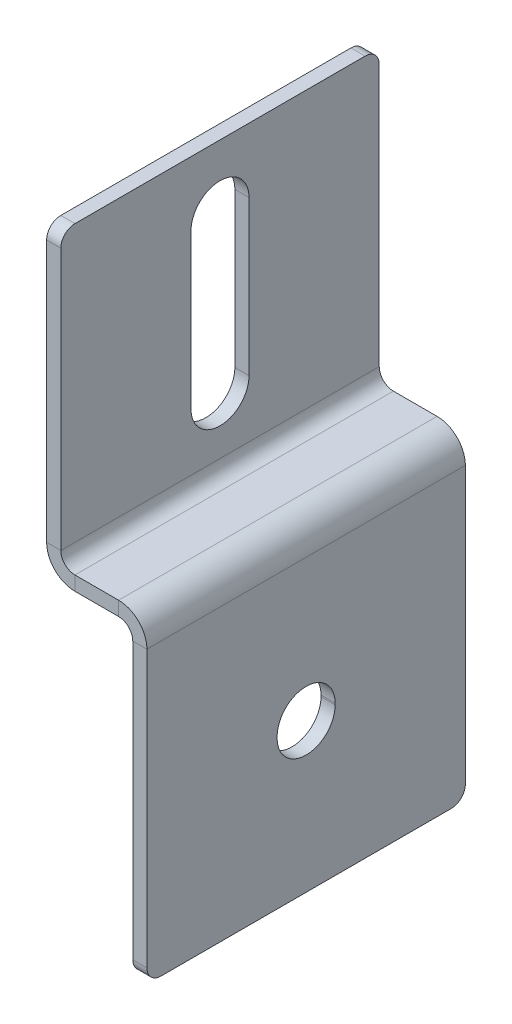
ISO-10303-21;
HEADER;
FILE_DESCRIPTION(('STEP AP214'),'2;1');
FILE_NAME('part.step','',(''),(''),'','','');
FILE_SCHEMA(('AUTOMOTIVE_DESIGN { 1 0 10303 214 1 1 1 1 }'));
ENDSEC;
DATA;
#1=APPLICATION_CONTEXT('core data for automotive mechanical design processes');
#2=APPLICATION_PROTOCOL_DEFINITION('international standard','automotive_design',2000,#1);
#3=PRODUCT_CONTEXT('',#1,'mechanical');
#4=PRODUCT('Part','Part','',(#3));
#5=PRODUCT_RELATED_PRODUCT_CATEGORY('part','',(#4));
#6=PRODUCT_DEFINITION_FORMATION('','',#4);
#7=PRODUCT_DEFINITION_CONTEXT('part definition',#1,'design');
#8=PRODUCT_DEFINITION('design','',#6,#7);
#9=PRODUCT_DEFINITION_SHAPE('','',#8);
#10=(LENGTH_UNIT() NAMED_UNIT(*) SI_UNIT(.MILLI.,.METRE.));
#11=(NAMED_UNIT(*) PLANE_ANGLE_UNIT() SI_UNIT($,.RADIAN.));
#12=(NAMED_UNIT(*) SI_UNIT($,.STERADIAN.) SOLID_ANGLE_UNIT());
#13=UNCERTAINTY_MEASURE_WITH_UNIT(LENGTH_MEASURE(1.E-05),#10,'distance_accuracy_value','');
#14=(GEOMETRIC_REPRESENTATION_CONTEXT(3) GLOBAL_UNCERTAINTY_ASSIGNED_CONTEXT((#13)) GLOBAL_UNIT_ASSIGNED_CONTEXT((#10,
#11,#12)) REPRESENTATION_CONTEXT('',''));
#15=CARTESIAN_POINT('',(0.,0.,0.));
#16=DIRECTION('',(0.,0.,1.));
#17=DIRECTION('',(1.,0.,0.));
#18=AXIS2_PLACEMENT_3D('',#15,#16,#17);
#19=CARTESIAN_POINT('',(0.,-24.1,26.6));
#20=DIRECTION('',(0.,0.,-1.));
#21=DIRECTION('',(0.,-1.,0.));
#22=AXIS2_PLACEMENT_3D('',#19,#20,#21);
#23=PLANE('',#22);
#24=DIRECTION('',(1.,0.,0.));
#25=VECTOR('',#24,1.);
#26=CARTESIAN_POINT('',(0.,-24.1,26.6));
#27=LINE('',#26,#25);
#28=CARTESIAN_POINT('',(-2.,-24.1,26.6));
#29=VERTEX_POINT('',#28);
#30=CARTESIAN_POINT('',(0.,-24.1,26.6));
#31=VERTEX_POINT('',#30);
#32=EDGE_CURVE('E205',#29,#31,#27,.T.);
#33=ORIENTED_EDGE('',*,*,#32,.F.);
#34=DIRECTION('',(0.,-1.,0.));
#35=VECTOR('',#34,1.);
#36=CARTESIAN_POINT('',(-2.,0.,26.6));
#37=LINE('',#36,#35);
#38=CARTESIAN_POINT('',(-2.,-23.9,26.6));
#39=VERTEX_POINT('',#38);
#40=EDGE_CURVE('E325',#39,#29,#37,.T.);
#41=ORIENTED_EDGE('',*,*,#40,.F.);
#42=DIRECTION('',(1.,0.,0.));
#43=VECTOR('',#42,1.);
#44=CARTESIAN_POINT('',(0.,-23.9,26.6));
#45=LINE('',#44,#43);
#46=CARTESIAN_POINT('',(0.,-23.9,26.6));
#47=VERTEX_POINT('',#46);
#48=EDGE_CURVE('E354',#39,#47,#45,.T.);
#49=ORIENTED_EDGE('',*,*,#48,.T.);
#50=DIRECTION('',(0.,-1.,0.));
#51=VECTOR('',#50,1.);
#52=CARTESIAN_POINT('',(0.,-24.1,26.6));
#53=LINE('',#52,#51);
#54=EDGE_CURVE('E206',#47,#31,#53,.T.);
#55=ORIENTED_EDGE('',*,*,#54,.T.);
#56=EDGE_LOOP('',(#33,#41,#49,#55));
#57=FACE_BOUND('',#56,.T.);
#58=ADVANCED_FACE('F16',(#57),#23,.T.);
#59=CARTESIAN_POINT('',(0.,-23.9,22.5));
#60=DIRECTION('',(-1.,0.,0.));
#61=DIRECTION('',(0.,-1.,0.));
#62=AXIS2_PLACEMENT_3D('',#59,#60,#61);
#63=CYLINDRICAL_SURFACE('',#62,4.09999999999999);
#64=ORIENTED_EDGE('',*,*,#48,.F.);
#65=CARTESIAN_POINT('',(-1.99999999999998,-23.9,22.5));
#66=DIRECTION('',(1.,0.,0.));
#67=DIRECTION('',(0.,1.,0.));
#68=AXIS2_PLACEMENT_3D('',#65,#66,#67);
#69=CIRCLE('',#68,4.09999999999999);
#70=CARTESIAN_POINT('',(-2.,-23.9,18.4));
#71=VERTEX_POINT('',#70);
#72=EDGE_CURVE('E311',#71,#39,#69,.T.);
#73=ORIENTED_EDGE('',*,*,#72,.F.);
#74=DIRECTION('',(1.,0.,0.));
#75=VECTOR('',#74,1.);
#76=CARTESIAN_POINT('',(0.,-23.9,18.4));
#77=LINE('',#76,#75);
#78=CARTESIAN_POINT('',(0.,-23.9,18.4));
#79=VERTEX_POINT('',#78);
#80=EDGE_CURVE('E190',#71,#79,#77,.T.);
#81=ORIENTED_EDGE('',*,*,#80,.T.);
#82=CARTESIAN_POINT('',(0.,-23.9,22.5));
#83=DIRECTION('',(1.,0.,0.));
#84=DIRECTION('',(0.,1.,0.));
#85=AXIS2_PLACEMENT_3D('',#82,#83,#84);
#86=CIRCLE('',#85,4.09999999999999);
#87=EDGE_CURVE('E201',#79,#47,#86,.T.);
#88=ORIENTED_EDGE('',*,*,#87,.T.);
#89=EDGE_LOOP('',(#64,#73,#81,#88));
#90=FACE_BOUND('',#89,.T.);
#91=ADVANCED_FACE('F489',(#90),#63,.F.);
#92=CARTESIAN_POINT('',(0.,-24.1,18.4));
#93=DIRECTION('',(0.,0.,1.));
#94=DIRECTION('',(0.,1.,0.));
#95=AXIS2_PLACEMENT_3D('',#92,#93,#94);
#96=PLANE('',#95);
#97=ORIENTED_EDGE('',*,*,#80,.F.);
#98=DIRECTION('',(0.,-1.,0.));
#99=VECTOR('',#98,1.);
#100=CARTESIAN_POINT('',(-2.,0.,18.4));
#101=LINE('',#100,#99);
#102=CARTESIAN_POINT('',(-2.,-24.1,18.4));
#103=VERTEX_POINT('',#102);
#104=EDGE_CURVE('E185',#103,#71,#101,.F.);
#105=ORIENTED_EDGE('',*,*,#104,.F.);
#106=DIRECTION('',(1.,0.,0.));
#107=VECTOR('',#106,1.);
#108=CARTESIAN_POINT('',(0.,-24.1,18.4));
#109=LINE('',#108,#107);
#110=CARTESIAN_POINT('',(0.,-24.1,18.4));
#111=VERTEX_POINT('',#110);
#112=EDGE_CURVE('E179',#103,#111,#109,.T.);
#113=ORIENTED_EDGE('',*,*,#112,.T.);
#114=DIRECTION('',(0.,1.,0.));
#115=VECTOR('',#114,1.);
#116=CARTESIAN_POINT('',(0.,-24.1,18.4));
#117=LINE('',#116,#115);
#118=EDGE_CURVE('E182',#111,#79,#117,.T.);
#119=ORIENTED_EDGE('',*,*,#118,.T.);
#120=EDGE_LOOP('',(#97,#105,#113,#119));
#121=FACE_BOUND('',#120,.T.);
#122=ADVANCED_FACE('F181',(#121),#96,.T.);
#123=CARTESIAN_POINT('',(-12.17,0.,45.));
#124=DIRECTION('',(0.,0.,1.));
#125=DIRECTION('',(-1.,0.,0.));
#126=AXIS2_PLACEMENT_3D('',#123,#124,#125);
#127=PLANE('',#126);
#128=DIRECTION('',(0.,1.,0.));
#129=VECTOR('',#128,1.);
#130=CARTESIAN_POINT('',(-10.17,0.,45.));
#131=LINE('',#130,#129);
#132=CARTESIAN_POINT('',(-10.17,-1.99999999999999,45.));
#133=VERTEX_POINT('',#132);
#134=CARTESIAN_POINT('',(-10.17,0.,45.));
#135=VERTEX_POINT('',#134);
#136=EDGE_CURVE('E191',#133,#135,#131,.T.);
#137=ORIENTED_EDGE('',*,*,#136,.F.);
#138=DIRECTION('',(1.,0.,0.));
#139=VECTOR('',#138,1.);
#140=CARTESIAN_POINT('',(-12.17,-2.,45.));
#141=LINE('',#140,#139);
#142=CARTESIAN_POINT('',(-4.00000000000001,-2.,45.));
#143=VERTEX_POINT('',#142);
#144=EDGE_CURVE('E303',#143,#133,#141,.F.);
#145=ORIENTED_EDGE('',*,*,#144,.F.);
#146=DIRECTION('',(0.,1.,0.));
#147=VECTOR('',#146,1.);
#148=CARTESIAN_POINT('',(-4.,0.,45.));
#149=LINE('',#148,#147);
#150=CARTESIAN_POINT('',(-4.,0.,45.));
#151=VERTEX_POINT('',#150);
#152=EDGE_CURVE('E349',#143,#151,#149,.T.);
#153=ORIENTED_EDGE('',*,*,#152,.T.);
#154=DIRECTION('',(-1.,0.,0.));
#155=VECTOR('',#154,1.);
#156=CARTESIAN_POINT('',(-12.17,0.,45.));
#157=LINE('',#156,#155);
#158=EDGE_CURVE('E202',#151,#135,#157,.T.);
#159=ORIENTED_EDGE('',*,*,#158,.T.);
#160=EDGE_LOOP('',(#137,#145,#153,#159));
#161=FACE_BOUND('',#160,.T.);
#162=ADVANCED_FACE('F417',(#161),#127,.T.);
#163=CARTESIAN_POINT('',(-4.,-4.,45.));
#164=DIRECTION('',(0.,0.,-1.));
#165=DIRECTION('',(-1.,0.,0.));
#166=AXIS2_PLACEMENT_3D('',#163,#164,#165);
#167=PLANE('',#166);
#168=ORIENTED_EDGE('',*,*,#152,.F.);
#169=CARTESIAN_POINT('',(-4.,-4.,45.));
#170=DIRECTION('',(0.,0.,-1.));
#171=DIRECTION('',(-1.,0.,0.));
#172=AXIS2_PLACEMENT_3D('',#169,#170,#171);
#173=CIRCLE('',#172,2.);
#174=CARTESIAN_POINT('',(-2.,-4.,45.));
#175=VERTEX_POINT('',#174);
#176=EDGE_CURVE('E304',#143,#175,#173,.T.);
#177=ORIENTED_EDGE('',*,*,#176,.T.);
#178=DIRECTION('',(1.,0.,0.));
#179=VECTOR('',#178,1.);
#180=CARTESIAN_POINT('',(0.,-4.,45.));
#181=LINE('',#180,#179);
#182=CARTESIAN_POINT('',(0.,-4.,45.));
#183=VERTEX_POINT('',#182);
#184=EDGE_CURVE('E346',#175,#183,#181,.T.);
#185=ORIENTED_EDGE('',*,*,#184,.T.);
#186=CARTESIAN_POINT('',(-4.,-4.,45.));
#187=DIRECTION('',(0.,0.,1.));
#188=DIRECTION('',(1.,0.,0.));
#189=AXIS2_PLACEMENT_3D('',#186,#187,#188);
#190=CIRCLE('',#189,4.);
#191=EDGE_CURVE('E248',#151,#183,#190,.F.);
#192=ORIENTED_EDGE('',*,*,#191,.F.);
#193=EDGE_LOOP('',(#168,#177,#185,#192));
#194=FACE_BOUND('',#193,.T.);
#195=ADVANCED_FACE('F450',(#194),#167,.F.);
#196=CARTESIAN_POINT('',(0.,0.,45.));
#197=DIRECTION('',(0.,0.,1.));
#198=DIRECTION('',(0.,1.,0.));
#199=AXIS2_PLACEMENT_3D('',#196,#197,#198);
#200=PLANE('',#199);
#201=DIRECTION('',(0.,-1.,0.));
#202=VECTOR('',#201,1.);
#203=CARTESIAN_POINT('',(-2.,0.,45.));
#204=LINE('',#203,#202);
#205=CARTESIAN_POINT('',(-1.99999999999999,-43.,45.));
#206=VERTEX_POINT('',#205);
#207=EDGE_CURVE('E310',#206,#175,#204,.F.);
#208=ORIENTED_EDGE('',*,*,#207,.F.);
#209=DIRECTION('',(-1.,0.,0.));
#210=VECTOR('',#209,1.);
#211=CARTESIAN_POINT('',(0.,-43.,45.));
#212=LINE('',#211,#210);
#213=CARTESIAN_POINT('',(0.,-43.,45.));
#214=VERTEX_POINT('',#213);
#215=EDGE_CURVE('E372',#206,#214,#212,.F.);
#216=ORIENTED_EDGE('',*,*,#215,.T.);
#217=DIRECTION('',(0.,1.,0.));
#218=VECTOR('',#217,1.);
#219=CARTESIAN_POINT('',(0.,0.,45.));
#220=LINE('',#219,#218);
#221=EDGE_CURVE('E214',#214,#183,#220,.T.);
#222=ORIENTED_EDGE('',*,*,#221,.T.);
#223=ORIENTED_EDGE('',*,*,#184,.F.);
#224=EDGE_LOOP('',(#208,#216,#222,#223));
#225=FACE_BOUND('',#224,.T.);
#226=ADVANCED_FACE('F478',(#225),#200,.T.);
#227=CARTESIAN_POINT('',(0.,-45.,45.));
#228=DIRECTION('',(0.,1.,0.));
#229=DIRECTION('',(0.,0.,-1.));
#230=AXIS2_PLACEMENT_3D('',#227,#228,#229);
#231=PLANE('',#230);
#232=DIRECTION('',(0.,0.,1.));
#233=VECTOR('',#232,1.);
#234=CARTESIAN_POINT('',(-1.99999999999999,-45.,45.));
#235=LINE('',#234,#233);
#236=CARTESIAN_POINT('',(-1.99999999999999,-45.,43.));
#237=VERTEX_POINT('',#236);
#238=CARTESIAN_POINT('',(-1.99999999999999,-45.,2.00000000000002));
#239=VERTEX_POINT('',#238);
#240=EDGE_CURVE('E281',#237,#239,#235,.F.);
#241=ORIENTED_EDGE('',*,*,#240,.T.);
#242=DIRECTION('',(-1.,0.,0.));
#243=VECTOR('',#242,1.);
#244=CARTESIAN_POINT('',(0.,-45.,2.));
#245=LINE('',#244,#243);
#246=CARTESIAN_POINT('',(0.,-45.,2.00000000000002));
#247=VERTEX_POINT('',#246);
#248=EDGE_CURVE('E359',#239,#247,#245,.F.);
#249=ORIENTED_EDGE('',*,*,#248,.T.);
#250=DIRECTION('',(0.,0.,-1.));
#251=VECTOR('',#250,1.);
#252=CARTESIAN_POINT('',(0.,-45.,45.));
#253=LINE('',#252,#251);
#254=CARTESIAN_POINT('',(0.,-45.,43.));
#255=VERTEX_POINT('',#254);
#256=EDGE_CURVE('E216',#255,#247,#253,.T.);
#257=ORIENTED_EDGE('',*,*,#256,.F.);
#258=DIRECTION('',(1.,0.,0.));
#259=VECTOR('',#258,1.);
#260=CARTESIAN_POINT('',(0.,-45.,43.));
#261=LINE('',#260,#259);
#262=EDGE_CURVE('E356',#255,#237,#261,.F.);
#263=ORIENTED_EDGE('',*,*,#262,.T.);
#264=EDGE_LOOP('',(#241,#249,#257,#263));
#265=FACE_BOUND('',#264,.T.);
#266=ADVANCED_FACE('F470',(#265),#231,.F.);
#267=CARTESIAN_POINT('',(0.,0.,0.));
#268=DIRECTION('',(0.,0.,1.));
#269=DIRECTION('',(0.,1.,0.));
#270=AXIS2_PLACEMENT_3D('',#267,#268,#269);
#271=PLANE('',#270);
#272=DIRECTION('',(0.,1.,0.));
#273=VECTOR('',#272,1.);
#274=CARTESIAN_POINT('',(0.,0.,0.));
#275=LINE('',#274,#273);
#276=CARTESIAN_POINT('',(0.,-43.,0.));
#277=VERTEX_POINT('',#276);
#278=CARTESIAN_POINT('',(0.,-4.,0.));
#279=VERTEX_POINT('',#278);
#280=EDGE_CURVE('E212',#277,#279,#275,.T.);
#281=ORIENTED_EDGE('',*,*,#280,.F.);
#282=DIRECTION('',(-1.,0.,0.));
#283=VECTOR('',#282,1.);
#284=CARTESIAN_POINT('',(0.,-43.,0.));
#285=LINE('',#284,#283);
#286=CARTESIAN_POINT('',(-1.99999999999999,-43.,0.));
#287=VERTEX_POINT('',#286);
#288=EDGE_CURVE('E366',#277,#287,#285,.T.);
#289=ORIENTED_EDGE('',*,*,#288,.T.);
#290=DIRECTION('',(0.,-1.,0.));
#291=VECTOR('',#290,1.);
#292=CARTESIAN_POINT('',(-2.,0.,0.));
#293=LINE('',#292,#291);
#294=CARTESIAN_POINT('',(-2.,-4.,0.));
#295=VERTEX_POINT('',#294);
#296=EDGE_CURVE('E308',#287,#295,#293,.F.);
#297=ORIENTED_EDGE('',*,*,#296,.T.);
#298=DIRECTION('',(1.,0.,0.));
#299=VECTOR('',#298,1.);
#300=CARTESIAN_POINT('',(0.,-4.,0.));
#301=LINE('',#300,#299);
#302=EDGE_CURVE('E343',#295,#279,#301,.T.);
#303=ORIENTED_EDGE('',*,*,#302,.T.);
#304=EDGE_LOOP('',(#281,#289,#297,#303));
#305=FACE_BOUND('',#304,.T.);
#306=ADVANCED_FACE('F459',(#305),#271,.F.);
#307=CARTESIAN_POINT('',(-4.,-4.,0.));
#308=DIRECTION('',(0.,0.,1.));
#309=DIRECTION('',(1.,0.,0.));
#310=AXIS2_PLACEMENT_3D('',#307,#308,#309);
#311=PLANE('',#310);
#312=ORIENTED_EDGE('',*,*,#302,.F.);
#313=CARTESIAN_POINT('',(-4.,-4.,0.));
#314=DIRECTION('',(0.,0.,-1.));
#315=DIRECTION('',(-1.,0.,0.));
#316=AXIS2_PLACEMENT_3D('',#313,#314,#315);
#317=CIRCLE('',#316,2.);
#318=CARTESIAN_POINT('',(-4.,-2.,0.));
#319=VERTEX_POINT('',#318);
#320=EDGE_CURVE('E305',#295,#319,#317,.F.);
#321=ORIENTED_EDGE('',*,*,#320,.T.);
#322=DIRECTION('',(0.,1.,0.));
#323=VECTOR('',#322,1.);
#324=CARTESIAN_POINT('',(-4.,0.,0.));
#325=LINE('',#324,#323);
#326=CARTESIAN_POINT('',(-4.,0.,0.));
#327=VERTEX_POINT('',#326);
#328=EDGE_CURVE('E341',#319,#327,#325,.T.);
#329=ORIENTED_EDGE('',*,*,#328,.T.);
#330=CARTESIAN_POINT('',(-4.,-4.,0.));
#331=DIRECTION('',(0.,0.,-1.));
#332=DIRECTION('',(-1.,0.,0.));
#333=AXIS2_PLACEMENT_3D('',#330,#331,#332);
#334=CIRCLE('',#333,4.);
#335=EDGE_CURVE('E245',#279,#327,#334,.F.);
#336=ORIENTED_EDGE('',*,*,#335,.F.);
#337=EDGE_LOOP('',(#312,#321,#329,#336));
#338=FACE_BOUND('',#337,.T.);
#339=ADVANCED_FACE('F444',(#338),#311,.F.);
#340=CARTESIAN_POINT('',(-12.17,0.,0.));
#341=DIRECTION('',(0.,0.,1.));
#342=DIRECTION('',(-1.,0.,0.));
#343=AXIS2_PLACEMENT_3D('',#340,#341,#342);
#344=PLANE('',#343);
#345=ORIENTED_EDGE('',*,*,#328,.F.);
#346=DIRECTION('',(1.,0.,0.));
#347=VECTOR('',#346,1.);
#348=CARTESIAN_POINT('',(-12.17,-2.,0.));
#349=LINE('',#348,#347);
#350=CARTESIAN_POINT('',(-10.17,-2.,0.));
#351=VERTEX_POINT('',#350);
#352=EDGE_CURVE('E300',#319,#351,#349,.F.);
#353=ORIENTED_EDGE('',*,*,#352,.T.);
#354=DIRECTION('',(0.,1.,0.));
#355=VECTOR('',#354,1.);
#356=CARTESIAN_POINT('',(-10.17,0.,0.));
#357=LINE('',#356,#355);
#358=CARTESIAN_POINT('',(-10.17,0.,0.));
#359=VERTEX_POINT('',#358);
#360=EDGE_CURVE('E339',#351,#359,#357,.T.);
#361=ORIENTED_EDGE('',*,*,#360,.T.);
#362=DIRECTION('',(-1.,0.,0.));
#363=VECTOR('',#362,1.);
#364=CARTESIAN_POINT('',(-12.17,0.,0.));
#365=LINE('',#364,#363);
#366=EDGE_CURVE('E252',#327,#359,#365,.T.);
#367=ORIENTED_EDGE('',*,*,#366,.F.);
#368=EDGE_LOOP('',(#345,#353,#361,#367));
#369=FACE_BOUND('',#368,.T.);
#370=ADVANCED_FACE('F436',(#369),#344,.F.);
#371=CARTESIAN_POINT('',(-10.17,2.00000000000001,0.));
#372=DIRECTION('',(0.,0.,-1.));
#373=DIRECTION('',(-1.,0.,0.));
#374=AXIS2_PLACEMENT_3D('',#371,#372,#373);
#375=PLANE('',#374);
#376=ORIENTED_EDGE('',*,*,#360,.F.);
#377=CARTESIAN_POINT('',(-10.17,2.00000000000001,0.));
#378=DIRECTION('',(0.,0.,1.));
#379=DIRECTION('',(1.,0.,0.));
#380=AXIS2_PLACEMENT_3D('',#377,#378,#379);
#381=CIRCLE('',#380,4.);
#382=CARTESIAN_POINT('',(-14.17,2.00000000000001,0.));
#383=VERTEX_POINT('',#382);
#384=EDGE_CURVE('E296',#351,#383,#381,.F.);
#385=ORIENTED_EDGE('',*,*,#384,.T.);
#386=DIRECTION('',(1.,0.,0.));
#387=VECTOR('',#386,1.);
#388=CARTESIAN_POINT('',(-12.17,2.00000000000001,0.));
#389=LINE('',#388,#387);
#390=CARTESIAN_POINT('',(-12.17,2.00000000000001,0.));
#391=VERTEX_POINT('',#390);
#392=EDGE_CURVE('E337',#383,#391,#389,.T.);
#393=ORIENTED_EDGE('',*,*,#392,.T.);
#394=CARTESIAN_POINT('',(-10.17,2.00000000000001,0.));
#395=DIRECTION('',(0.,0.,1.));
#396=DIRECTION('',(1.,0.,0.));
#397=AXIS2_PLACEMENT_3D('',#394,#395,#396);
#398=CIRCLE('',#397,2.);
#399=EDGE_CURVE('E259',#359,#391,#398,.F.);
#400=ORIENTED_EDGE('',*,*,#399,.F.);
#401=EDGE_LOOP('',(#376,#385,#393,#400));
#402=FACE_BOUND('',#401,.T.);
#403=ADVANCED_FACE('F429',(#402),#375,.T.);
#404=CARTESIAN_POINT('',(-12.17,41.,0.));
#405=DIRECTION('',(0.,0.,1.));
#406=DIRECTION('',(0.,1.,0.));
#407=AXIS2_PLACEMENT_3D('',#404,#405,#406);
#408=PLANE('',#407);
#409=DIRECTION('',(0.,-1.,0.));
#410=VECTOR('',#409,1.);
#411=CARTESIAN_POINT('',(-14.17,41.,0.));
#412=LINE('',#411,#410);
#413=CARTESIAN_POINT('',(-14.17,39.,0.));
#414=VERTEX_POINT('',#413);
#415=EDGE_CURVE('E285',#383,#414,#412,.F.);
#416=ORIENTED_EDGE('',*,*,#415,.T.);
#417=DIRECTION('',(1.,0.,0.));
#418=VECTOR('',#417,1.);
#419=CARTESIAN_POINT('',(-12.17,39.,0.));
#420=LINE('',#419,#418);
#421=CARTESIAN_POINT('',(-12.17,39.,0.));
#422=VERTEX_POINT('',#421);
#423=EDGE_CURVE('E375',#414,#422,#420,.T.);
#424=ORIENTED_EDGE('',*,*,#423,.T.);
#425=DIRECTION('',(0.,1.,0.));
#426=VECTOR('',#425,1.);
#427=CARTESIAN_POINT('',(-12.17,41.,0.));
#428=LINE('',#427,#426);
#429=EDGE_CURVE('E231',#391,#422,#428,.T.);
#430=ORIENTED_EDGE('',*,*,#429,.F.);
#431=ORIENTED_EDGE('',*,*,#392,.F.);
#432=EDGE_LOOP('',(#416,#424,#430,#431));
#433=FACE_BOUND('',#432,.T.);
#434=ADVANCED_FACE('F395',(#433),#408,.F.);
#435=CARTESIAN_POINT('',(-12.17,41.,45.));
#436=DIRECTION('',(0.,1.,0.));
#437=DIRECTION('',(0.,0.,-1.));
#438=AXIS2_PLACEMENT_3D('',#435,#436,#437);
#439=PLANE('',#438);
#440=DIRECTION('',(0.,0.,-1.));
#441=VECTOR('',#440,1.);
#442=CARTESIAN_POINT('',(-12.17,41.,45.));
#443=LINE('',#442,#441);
#444=CARTESIAN_POINT('',(-12.17,41.,43.));
#445=VERTEX_POINT('',#444);
#446=CARTESIAN_POINT('',(-12.17,41.,2.00000000000002));
#447=VERTEX_POINT('',#446);
#448=EDGE_CURVE('E234',#445,#447,#443,.T.);
#449=ORIENTED_EDGE('',*,*,#448,.T.);
#450=DIRECTION('',(-1.,0.,0.));
#451=VECTOR('',#450,1.);
#452=CARTESIAN_POINT('',(-12.17,41.,2.));
#453=LINE('',#452,#451);
#454=CARTESIAN_POINT('',(-14.17,41.,2.00000000000002));
#455=VERTEX_POINT('',#454);
#456=EDGE_CURVE('E37',#447,#455,#453,.T.);
#457=ORIENTED_EDGE('',*,*,#456,.T.);
#458=DIRECTION('',(0.,0.,1.));
#459=VECTOR('',#458,1.);
#460=CARTESIAN_POINT('',(-14.17,41.,45.));
#461=LINE('',#460,#459);
#462=CARTESIAN_POINT('',(-14.17,41.,43.));
#463=VERTEX_POINT('',#462);
#464=EDGE_CURVE('E292',#463,#455,#461,.F.);
#465=ORIENTED_EDGE('',*,*,#464,.F.);
#466=DIRECTION('',(1.,0.,0.));
#467=VECTOR('',#466,1.);
#468=CARTESIAN_POINT('',(-12.17,41.,43.));
#469=LINE('',#468,#467);
#470=EDGE_CURVE('E382',#463,#445,#469,.T.);
#471=ORIENTED_EDGE('',*,*,#470,.T.);
#472=EDGE_LOOP('',(#449,#457,#465,#471));
#473=FACE_BOUND('',#472,.T.);
#474=ADVANCED_FACE('F401',(#473),#439,.T.);
#475=CARTESIAN_POINT('',(-12.17,41.,45.));
#476=DIRECTION('',(0.,0.,1.));
#477=DIRECTION('',(0.,1.,0.));
#478=AXIS2_PLACEMENT_3D('',#475,#476,#477);
#479=PLANE('',#478);
#480=DIRECTION('',(0.,1.,0.));
#481=VECTOR('',#480,1.);
#482=CARTESIAN_POINT('',(-12.17,41.,45.));
#483=LINE('',#482,#481);
#484=CARTESIAN_POINT('',(-12.17,2.00000000000001,45.));
#485=VERTEX_POINT('',#484);
#486=CARTESIAN_POINT('',(-12.17,39.,45.));
#487=VERTEX_POINT('',#486);
#488=EDGE_CURVE('E236',#485,#487,#483,.T.);
#489=ORIENTED_EDGE('',*,*,#488,.T.);
#490=DIRECTION('',(1.,0.,0.));
#491=VECTOR('',#490,1.);
#492=CARTESIAN_POINT('',(-12.17,39.,45.));
#493=LINE('',#492,#491);
#494=CARTESIAN_POINT('',(-14.17,39.,45.));
#495=VERTEX_POINT('',#494);
#496=EDGE_CURVE('E10',#487,#495,#493,.F.);
#497=ORIENTED_EDGE('',*,*,#496,.T.);
#498=DIRECTION('',(0.,-1.,0.));
#499=VECTOR('',#498,1.);
#500=CARTESIAN_POINT('',(-14.17,41.,45.));
#501=LINE('',#500,#499);
#502=CARTESIAN_POINT('',(-14.17,2.00000000000001,45.));
#503=VERTEX_POINT('',#502);
#504=EDGE_CURVE('E274',#503,#495,#501,.F.);
#505=ORIENTED_EDGE('',*,*,#504,.F.);
#506=DIRECTION('',(1.,0.,0.));
#507=VECTOR('',#506,1.);
#508=CARTESIAN_POINT('',(-12.17,2.00000000000001,45.));
#509=LINE('',#508,#507);
#510=EDGE_CURVE('E335',#503,#485,#509,.T.);
#511=ORIENTED_EDGE('',*,*,#510,.T.);
#512=EDGE_LOOP('',(#489,#497,#505,#511));
#513=FACE_BOUND('',#512,.T.);
#514=ADVANCED_FACE('F407',(#513),#479,.T.);
#515=CARTESIAN_POINT('',(-12.17,41.,18.4));
#516=DIRECTION('',(0.,0.,-1.));
#517=DIRECTION('',(0.,-1.,0.));
#518=AXIS2_PLACEMENT_3D('',#515,#516,#517);
#519=PLANE('',#518);
#520=DIRECTION('',(1.,0.,0.));
#521=VECTOR('',#520,1.);
#522=CARTESIAN_POINT('',(-12.17,31.9,18.4));
#523=LINE('',#522,#521);
#524=CARTESIAN_POINT('',(-14.17,31.9,18.4));
#525=VERTEX_POINT('',#524);
#526=CARTESIAN_POINT('',(-12.17,31.9,18.4));
#527=VERTEX_POINT('',#526);
#528=EDGE_CURVE('E333',#525,#527,#523,.T.);
#529=ORIENTED_EDGE('',*,*,#528,.F.);
#530=DIRECTION('',(0.,-1.,0.));
#531=VECTOR('',#530,1.);
#532=CARTESIAN_POINT('',(-14.17,41.,18.4));
#533=LINE('',#532,#531);
#534=CARTESIAN_POINT('',(-14.17,10.1,18.4));
#535=VERTEX_POINT('',#534);
#536=EDGE_CURVE('E286',#525,#535,#533,.T.);
#537=ORIENTED_EDGE('',*,*,#536,.T.);
#538=DIRECTION('',(1.,0.,0.));
#539=VECTOR('',#538,1.);
#540=CARTESIAN_POINT('',(-12.17,10.1,18.4));
#541=LINE('',#540,#539);
#542=CARTESIAN_POINT('',(-12.17,10.1,18.4));
#543=VERTEX_POINT('',#542);
#544=EDGE_CURVE('E331',#535,#543,#541,.T.);
#545=ORIENTED_EDGE('',*,*,#544,.T.);
#546=DIRECTION('',(0.,-1.,0.));
#547=VECTOR('',#546,1.);
#548=CARTESIAN_POINT('',(-12.17,41.,18.4));
#549=LINE('',#548,#547);
#550=EDGE_CURVE('E225',#527,#543,#549,.T.);
#551=ORIENTED_EDGE('',*,*,#550,.F.);
#552=EDGE_LOOP('',(#529,#537,#545,#551));
#553=FACE_BOUND('',#552,.T.);
#554=ADVANCED_FACE('F662',(#553),#519,.F.);
#555=CARTESIAN_POINT('',(-12.17,10.1,22.5));
#556=DIRECTION('',(-1.,0.,0.));
#557=DIRECTION('',(0.,-1.,0.));
#558=AXIS2_PLACEMENT_3D('',#555,#556,#557);
#559=CYLINDRICAL_SURFACE('',#558,4.1);
#560=ORIENTED_EDGE('',*,*,#544,.F.);
#561=CARTESIAN_POINT('',(-14.17,10.1,22.5));
#562=DIRECTION('',(-1.,0.,0.));
#563=DIRECTION('',(0.,-1.,0.));
#564=AXIS2_PLACEMENT_3D('',#561,#562,#563);
#565=CIRCLE('',#564,4.1);
#566=CARTESIAN_POINT('',(-14.17,10.1,26.6));
#567=VERTEX_POINT('',#566);
#568=EDGE_CURVE('E282',#535,#567,#565,.T.);
#569=ORIENTED_EDGE('',*,*,#568,.T.);
#570=DIRECTION('',(1.,0.,0.));
#571=VECTOR('',#570,1.);
#572=CARTESIAN_POINT('',(-12.17,10.1,26.6));
#573=LINE('',#572,#571);
#574=CARTESIAN_POINT('',(-12.17,10.1,26.6));
#575=VERTEX_POINT('',#574);
#576=EDGE_CURVE('E329',#567,#575,#573,.T.);
#577=ORIENTED_EDGE('',*,*,#576,.T.);
#578=CARTESIAN_POINT('',(-12.17,10.1,22.5));
#579=DIRECTION('',(-1.,0.,0.));
#580=DIRECTION('',(0.,-1.,0.));
#581=AXIS2_PLACEMENT_3D('',#578,#579,#580);
#582=CIRCLE('',#581,4.1);
#583=EDGE_CURVE('E228',#543,#575,#582,.T.);
#584=ORIENTED_EDGE('',*,*,#583,.F.);
#585=EDGE_LOOP('',(#560,#569,#577,#584));
#586=FACE_BOUND('',#585,.T.);
#587=ADVANCED_FACE('F652',(#586),#559,.F.);
#588=CARTESIAN_POINT('',(-12.17,41.,26.6));
#589=DIRECTION('',(0.,0.,1.));
#590=DIRECTION('',(0.,1.,0.));
#591=AXIS2_PLACEMENT_3D('',#588,#589,#590);
#592=PLANE('',#591);
#593=ORIENTED_EDGE('',*,*,#576,.F.);
#594=DIRECTION('',(0.,-1.,0.));
#595=VECTOR('',#594,1.);
#596=CARTESIAN_POINT('',(-14.17,41.,26.6));
#597=LINE('',#596,#595);
#598=CARTESIAN_POINT('',(-14.17,31.9,26.6));
#599=VERTEX_POINT('',#598);
#600=EDGE_CURVE('E277',#567,#599,#597,.F.);
#601=ORIENTED_EDGE('',*,*,#600,.T.);
#602=DIRECTION('',(1.,0.,0.));
#603=VECTOR('',#602,1.);
#604=CARTESIAN_POINT('',(-12.17,31.9,26.6));
#605=LINE('',#604,#603);
#606=CARTESIAN_POINT('',(-12.17,31.9,26.6));
#607=VERTEX_POINT('',#606);
#608=EDGE_CURVE('E258',#599,#607,#605,.T.);
#609=ORIENTED_EDGE('',*,*,#608,.T.);
#610=DIRECTION('',(0.,1.,0.));
#611=VECTOR('',#610,1.);
#612=CARTESIAN_POINT('',(-12.17,41.,26.6));
#613=LINE('',#612,#611);
#614=EDGE_CURVE('E219',#575,#607,#613,.T.);
#615=ORIENTED_EDGE('',*,*,#614,.F.);
#616=EDGE_LOOP('',(#593,#601,#609,#615));
#617=FACE_BOUND('',#616,.T.);
#618=ADVANCED_FACE('F502',(#617),#592,.F.);
#619=CARTESIAN_POINT('',(0.,-24.1,22.5));
#620=DIRECTION('',(-1.,0.,0.));
#621=DIRECTION('',(0.,-1.,0.));
#622=AXIS2_PLACEMENT_3D('',#619,#620,#621);
#623=CYLINDRICAL_SURFACE('',#622,4.09999999999999);
#624=CARTESIAN_POINT('',(-1.99999999999998,-24.1,22.5));
#625=DIRECTION('',(1.,0.,0.));
#626=DIRECTION('',(0.,1.,0.));
#627=AXIS2_PLACEMENT_3D('',#624,#625,#626);
#628=CIRCLE('',#627,4.09999999999999);
#629=EDGE_CURVE('E322',#29,#103,#628,.T.);
#630=ORIENTED_EDGE('',*,*,#629,.F.);
#631=ORIENTED_EDGE('',*,*,#32,.T.);
#632=CARTESIAN_POINT('',(0.,-24.1,22.5));
#633=DIRECTION('',(1.,0.,0.));
#634=DIRECTION('',(0.,1.,0.));
#635=AXIS2_PLACEMENT_3D('',#632,#633,#634);
#636=CIRCLE('',#635,4.09999999999999);
#637=EDGE_CURVE('E198',#31,#111,#636,.T.);
#638=ORIENTED_EDGE('',*,*,#637,.T.);
#639=ORIENTED_EDGE('',*,*,#112,.F.);
#640=EDGE_LOOP('',(#630,#631,#638,#639));
#641=FACE_BOUND('',#640,.T.);
#642=ADVANCED_FACE('F204',(#641),#623,.F.);
#643=CARTESIAN_POINT('',(-12.17,31.9,22.5));
#644=DIRECTION('',(-1.,0.,0.));
#645=DIRECTION('',(0.,-1.,0.));
#646=AXIS2_PLACEMENT_3D('',#643,#644,#645);
#647=CYLINDRICAL_SURFACE('',#646,4.1);
#648=CARTESIAN_POINT('',(-14.17,31.9,22.5));
#649=DIRECTION('',(-1.,0.,0.));
#650=DIRECTION('',(0.,-1.,0.));
#651=AXIS2_PLACEMENT_3D('',#648,#649,#650);
#652=CIRCLE('',#651,4.1);
#653=EDGE_CURVE('E280',#599,#525,#652,.T.);
#654=ORIENTED_EDGE('',*,*,#653,.T.);
#655=ORIENTED_EDGE('',*,*,#528,.T.);
#656=CARTESIAN_POINT('',(-12.17,31.9,22.5));
#657=DIRECTION('',(-1.,0.,0.));
#658=DIRECTION('',(0.,-1.,0.));
#659=AXIS2_PLACEMENT_3D('',#656,#657,#658);
#660=CIRCLE('',#659,4.1);
#661=EDGE_CURVE('E222',#607,#527,#660,.T.);
#662=ORIENTED_EDGE('',*,*,#661,.F.);
#663=ORIENTED_EDGE('',*,*,#608,.F.);
#664=EDGE_LOOP('',(#654,#655,#662,#663));
#665=FACE_BOUND('',#664,.T.);
#666=ADVANCED_FACE('F501',(#665),#647,.F.);
#667=CARTESIAN_POINT('',(-10.17,2.00000000000001,45.));
#668=DIRECTION('',(0.,0.,1.));
#669=DIRECTION('',(1.,0.,0.));
#670=AXIS2_PLACEMENT_3D('',#667,#668,#669);
#671=PLANE('',#670);
#672=CARTESIAN_POINT('',(-10.17,2.00000000000001,45.));
#673=DIRECTION('',(0.,0.,1.));
#674=DIRECTION('',(1.,0.,0.));
#675=AXIS2_PLACEMENT_3D('',#672,#673,#674);
#676=CIRCLE('',#675,4.);
#677=EDGE_CURVE('E299',#503,#133,#676,.T.);
#678=ORIENTED_EDGE('',*,*,#677,.T.);
#679=ORIENTED_EDGE('',*,*,#136,.T.);
#680=CARTESIAN_POINT('',(-10.17,2.00000000000001,45.));
#681=DIRECTION('',(0.,0.,-1.));
#682=DIRECTION('',(-1.,0.,0.));
#683=AXIS2_PLACEMENT_3D('',#680,#681,#682);
#684=CIRCLE('',#683,2.);
#685=EDGE_CURVE('E249',#485,#135,#684,.F.);
#686=ORIENTED_EDGE('',*,*,#685,.F.);
#687=ORIENTED_EDGE('',*,*,#510,.F.);
#688=EDGE_LOOP('',(#678,#679,#686,#687));
#689=FACE_BOUND('',#688,.T.);
#690=ADVANCED_FACE('F410',(#689),#671,.T.);
#691=CARTESIAN_POINT('',(-12.17,41.,45.));
#692=DIRECTION('',(-1.,0.,0.));
#693=DIRECTION('',(0.,-1.,0.));
#694=AXIS2_PLACEMENT_3D('',#691,#692,#693);
#695=PLANE('',#694);
#696=ORIENTED_EDGE('',*,*,#614,.T.);
#697=ORIENTED_EDGE('',*,*,#661,.T.);
#698=ORIENTED_EDGE('',*,*,#550,.T.);
#699=ORIENTED_EDGE('',*,*,#583,.T.);
#700=EDGE_LOOP('',(#696,#697,#698,#699));
#701=FACE_BOUND('',#700,.T.);
#702=ORIENTED_EDGE('',*,*,#429,.T.);
#703=CARTESIAN_POINT('',(-12.17,39.,2.));
#704=DIRECTION('',(-1.,0.,0.));
#705=DIRECTION('',(0.,-1.,0.));
#706=AXIS2_PLACEMENT_3D('',#703,#704,#705);
#707=CIRCLE('',#706,2.);
#708=EDGE_CURVE('E380',#422,#447,#707,.F.);
#709=ORIENTED_EDGE('',*,*,#708,.T.);
#710=ORIENTED_EDGE('',*,*,#448,.F.);
#711=CARTESIAN_POINT('',(-12.17,39.,43.));
#712=DIRECTION('',(-1.,0.,0.));
#713=DIRECTION('',(0.,-1.,0.));
#714=AXIS2_PLACEMENT_3D('',#711,#712,#713);
#715=CIRCLE('',#714,2.);
#716=EDGE_CURVE('E378',#445,#487,#715,.F.);
#717=ORIENTED_EDGE('',*,*,#716,.T.);
#718=ORIENTED_EDGE('',*,*,#488,.F.);
#719=DIRECTION('',(0.,0.,-1.));
#720=VECTOR('',#719,1.);
#721=CARTESIAN_POINT('',(-12.17,2.00000000000001,0.));
#722=LINE('',#721,#720);
#723=EDGE_CURVE('E244',#485,#391,#722,.T.);
#724=ORIENTED_EDGE('',*,*,#723,.T.);
#725=EDGE_LOOP('',(#702,#709,#710,#717,#718,#724));
#726=FACE_BOUND('',#725,.T.);
#727=ADVANCED_FACE('F400',(#701,#726),#695,.F.);
#728=CARTESIAN_POINT('',(0.,0.,45.));
#729=DIRECTION('',(-1.,0.,0.));
#730=DIRECTION('',(0.,-1.,0.));
#731=AXIS2_PLACEMENT_3D('',#728,#729,#730);
#732=PLANE('',#731);
#733=ORIENTED_EDGE('',*,*,#118,.F.);
#734=ORIENTED_EDGE('',*,*,#637,.F.);
#735=ORIENTED_EDGE('',*,*,#54,.F.);
#736=ORIENTED_EDGE('',*,*,#87,.F.);
#737=EDGE_LOOP('',(#733,#734,#735,#736));
#738=FACE_BOUND('',#737,.T.);
#739=ORIENTED_EDGE('',*,*,#256,.T.);
#740=CARTESIAN_POINT('',(0.,-43.,2.));
#741=DIRECTION('',(-1.,0.,0.));
#742=DIRECTION('',(0.,-1.,0.));
#743=AXIS2_PLACEMENT_3D('',#740,#741,#742);
#744=CIRCLE('',#743,2.);
#745=EDGE_CURVE('E364',#247,#277,#744,.F.);
#746=ORIENTED_EDGE('',*,*,#745,.T.);
#747=ORIENTED_EDGE('',*,*,#280,.T.);
#748=DIRECTION('',(0.,0.,-1.));
#749=VECTOR('',#748,1.);
#750=CARTESIAN_POINT('',(0.,-4.,45.));
#751=LINE('',#750,#749);
#752=EDGE_CURVE('E241',#279,#183,#751,.F.);
#753=ORIENTED_EDGE('',*,*,#752,.T.);
#754=ORIENTED_EDGE('',*,*,#221,.F.);
#755=CARTESIAN_POINT('',(0.,-43.,43.));
#756=DIRECTION('',(-1.,0.,0.));
#757=DIRECTION('',(0.,-1.,0.));
#758=AXIS2_PLACEMENT_3D('',#755,#756,#757);
#759=CIRCLE('',#758,2.);
#760=EDGE_CURVE('E362',#214,#255,#759,.F.);
#761=ORIENTED_EDGE('',*,*,#760,.T.);
#762=EDGE_LOOP('',(#739,#746,#747,#753,#754,#761));
#763=FACE_BOUND('',#762,.T.);
#764=ADVANCED_FACE('F195',(#738,#763),#732,.F.);
#765=CARTESIAN_POINT('',(-12.17,0.,45.));
#766=DIRECTION('',(0.,-1.,0.));
#767=DIRECTION('',(0.,0.,-1.));
#768=AXIS2_PLACEMENT_3D('',#765,#766,#767);
#769=PLANE('',#768);
#770=ORIENTED_EDGE('',*,*,#366,.T.);
#771=DIRECTION('',(0.,0.,-1.));
#772=VECTOR('',#771,1.);
#773=CARTESIAN_POINT('',(-10.17,0.,45.));
#774=LINE('',#773,#772);
#775=EDGE_CURVE('E255',#359,#135,#774,.F.);
#776=ORIENTED_EDGE('',*,*,#775,.T.);
#777=ORIENTED_EDGE('',*,*,#158,.F.);
#778=DIRECTION('',(0.,0.,-1.));
#779=VECTOR('',#778,1.);
#780=CARTESIAN_POINT('',(-4.,0.,45.));
#781=LINE('',#780,#779);
#782=EDGE_CURVE('E238',#151,#327,#781,.T.);
#783=ORIENTED_EDGE('',*,*,#782,.T.);
#784=EDGE_LOOP('',(#770,#776,#777,#783));
#785=FACE_BOUND('',#784,.T.);
#786=ADVANCED_FACE('F422',(#785),#769,.F.);
#787=CARTESIAN_POINT('',(-4.,-4.,45.));
#788=DIRECTION('',(0.,0.,-1.));
#789=DIRECTION('',(-1.,0.,0.));
#790=AXIS2_PLACEMENT_3D('',#787,#788,#789);
#791=CYLINDRICAL_SURFACE('',#790,4.);
#792=ORIENTED_EDGE('',*,*,#191,.T.);
#793=ORIENTED_EDGE('',*,*,#752,.F.);
#794=ORIENTED_EDGE('',*,*,#335,.T.);
#795=ORIENTED_EDGE('',*,*,#782,.F.);
#796=EDGE_LOOP('',(#792,#793,#794,#795));
#797=FACE_BOUND('',#796,.T.);
#798=ADVANCED_FACE('F454',(#797),#791,.T.);
#799=CARTESIAN_POINT('',(-10.17,2.00000000000001,45.));
#800=DIRECTION('',(0.,0.,1.));
#801=DIRECTION('',(1.,0.,0.));
#802=AXIS2_PLACEMENT_3D('',#799,#800,#801);
#803=CYLINDRICAL_SURFACE('',#802,2.);
#804=ORIENTED_EDGE('',*,*,#685,.T.);
#805=ORIENTED_EDGE('',*,*,#775,.F.);
#806=ORIENTED_EDGE('',*,*,#399,.T.);
#807=ORIENTED_EDGE('',*,*,#723,.F.);
#808=EDGE_LOOP('',(#804,#805,#806,#807));
#809=FACE_BOUND('',#808,.T.);
#810=ADVANCED_FACE('F414',(#809),#803,.F.);
#811=CARTESIAN_POINT('',(-14.17,41.,45.));
#812=DIRECTION('',(-1.,0.,0.));
#813=DIRECTION('',(0.,-1.,0.));
#814=AXIS2_PLACEMENT_3D('',#811,#812,#813);
#815=PLANE('',#814);
#816=ORIENTED_EDGE('',*,*,#600,.F.);
#817=ORIENTED_EDGE('',*,*,#568,.F.);
#818=ORIENTED_EDGE('',*,*,#536,.F.);
#819=ORIENTED_EDGE('',*,*,#653,.F.);
#820=EDGE_LOOP('',(#816,#817,#818,#819));
#821=FACE_BOUND('',#820,.T.);
#822=ORIENTED_EDGE('',*,*,#464,.T.);
#823=CARTESIAN_POINT('',(-14.17,39.,2.));
#824=DIRECTION('',(-1.,0.,0.));
#825=DIRECTION('',(0.,-1.,0.));
#826=AXIS2_PLACEMENT_3D('',#823,#824,#825);
#827=CIRCLE('',#826,2.);
#828=EDGE_CURVE('E24',#455,#414,#827,.T.);
#829=ORIENTED_EDGE('',*,*,#828,.T.);
#830=ORIENTED_EDGE('',*,*,#415,.F.);
#831=DIRECTION('',(0.,0.,1.));
#832=VECTOR('',#831,1.);
#833=CARTESIAN_POINT('',(-14.17,2.00000000000001,45.));
#834=LINE('',#833,#832);
#835=EDGE_CURVE('E265',#503,#383,#834,.F.);
#836=ORIENTED_EDGE('',*,*,#835,.F.);
#837=ORIENTED_EDGE('',*,*,#504,.T.);
#838=CARTESIAN_POINT('',(-14.17,39.,43.));
#839=DIRECTION('',(-1.,0.,0.));
#840=DIRECTION('',(0.,-1.,0.));
#841=AXIS2_PLACEMENT_3D('',#838,#839,#840);
#842=CIRCLE('',#841,2.);
#843=EDGE_CURVE('E386',#495,#463,#842,.T.);
#844=ORIENTED_EDGE('',*,*,#843,.T.);
#845=EDGE_LOOP('',(#822,#829,#830,#836,#837,#844));
#846=FACE_BOUND('',#845,.T.);
#847=ADVANCED_FACE('F390',(#821,#846),#815,.T.);
#848=CARTESIAN_POINT('',(-2.,0.,45.));
#849=DIRECTION('',(-1.,0.,0.));
#850=DIRECTION('',(0.,-1.,0.));
#851=AXIS2_PLACEMENT_3D('',#848,#849,#850);
#852=PLANE('',#851);
#853=ORIENTED_EDGE('',*,*,#104,.T.);
#854=ORIENTED_EDGE('',*,*,#72,.T.);
#855=ORIENTED_EDGE('',*,*,#40,.T.);
#856=ORIENTED_EDGE('',*,*,#629,.T.);
#857=EDGE_LOOP('',(#853,#854,#855,#856));
#858=FACE_BOUND('',#857,.T.);
#859=ORIENTED_EDGE('',*,*,#296,.F.);
#860=CARTESIAN_POINT('',(-1.99999999999999,-43.,2.));
#861=DIRECTION('',(-1.,0.,0.));
#862=DIRECTION('',(0.,-1.,0.));
#863=AXIS2_PLACEMENT_3D('',#860,#861,#862);
#864=CIRCLE('',#863,2.);
#865=EDGE_CURVE('E370',#287,#239,#864,.T.);
#866=ORIENTED_EDGE('',*,*,#865,.T.);
#867=ORIENTED_EDGE('',*,*,#240,.F.);
#868=CARTESIAN_POINT('',(-1.99999999999999,-43.,43.));
#869=DIRECTION('',(-1.,0.,0.));
#870=DIRECTION('',(0.,-1.,0.));
#871=AXIS2_PLACEMENT_3D('',#868,#869,#870);
#872=CIRCLE('',#871,2.);
#873=EDGE_CURVE('E368',#237,#206,#872,.T.);
#874=ORIENTED_EDGE('',*,*,#873,.T.);
#875=ORIENTED_EDGE('',*,*,#207,.T.);
#876=DIRECTION('',(0.,0.,1.));
#877=VECTOR('',#876,1.);
#878=CARTESIAN_POINT('',(-2.,-4.,45.));
#879=LINE('',#878,#877);
#880=EDGE_CURVE('E268',#295,#175,#879,.T.);
#881=ORIENTED_EDGE('',*,*,#880,.F.);
#882=EDGE_LOOP('',(#859,#866,#867,#874,#875,#881));
#883=FACE_BOUND('',#882,.T.);
#884=ADVANCED_FACE('F463',(#858,#883),#852,.T.);
#885=CARTESIAN_POINT('',(-12.17,-2.,45.));
#886=DIRECTION('',(0.,-1.,0.));
#887=DIRECTION('',(0.,0.,-1.));
#888=AXIS2_PLACEMENT_3D('',#885,#886,#887);
#889=PLANE('',#888);
#890=ORIENTED_EDGE('',*,*,#352,.F.);
#891=DIRECTION('',(0.,0.,-1.));
#892=VECTOR('',#891,1.);
#893=CARTESIAN_POINT('',(-4.00000000000001,-2.,45.));
#894=LINE('',#893,#892);
#895=EDGE_CURVE('E271',#143,#319,#894,.T.);
#896=ORIENTED_EDGE('',*,*,#895,.F.);
#897=ORIENTED_EDGE('',*,*,#144,.T.);
#898=DIRECTION('',(0.,0.,-1.));
#899=VECTOR('',#898,1.);
#900=CARTESIAN_POINT('',(-10.17,-2.,45.));
#901=LINE('',#900,#899);
#902=EDGE_CURVE('E262',#351,#133,#901,.F.);
#903=ORIENTED_EDGE('',*,*,#902,.F.);
#904=EDGE_LOOP('',(#890,#896,#897,#903));
#905=FACE_BOUND('',#904,.T.);
#906=ADVANCED_FACE('F439',(#905),#889,.T.);
#907=CARTESIAN_POINT('',(-4.,-4.,45.));
#908=DIRECTION('',(0.,0.,-1.));
#909=DIRECTION('',(-1.,0.,0.));
#910=AXIS2_PLACEMENT_3D('',#907,#908,#909);
#911=CYLINDRICAL_SURFACE('',#910,2.);
#912=ORIENTED_EDGE('',*,*,#176,.F.);
#913=ORIENTED_EDGE('',*,*,#895,.T.);
#914=ORIENTED_EDGE('',*,*,#320,.F.);
#915=ORIENTED_EDGE('',*,*,#880,.T.);
#916=EDGE_LOOP('',(#912,#913,#914,#915));
#917=FACE_BOUND('',#916,.T.);
#918=ADVANCED_FACE('F448',(#917),#911,.F.);
#919=CARTESIAN_POINT('',(-10.17,2.00000000000001,45.));
#920=DIRECTION('',(0.,0.,1.));
#921=DIRECTION('',(1.,0.,0.));
#922=AXIS2_PLACEMENT_3D('',#919,#920,#921);
#923=CYLINDRICAL_SURFACE('',#922,4.);
#924=ORIENTED_EDGE('',*,*,#677,.F.);
#925=ORIENTED_EDGE('',*,*,#835,.T.);
#926=ORIENTED_EDGE('',*,*,#384,.F.);
#927=ORIENTED_EDGE('',*,*,#902,.T.);
#928=EDGE_LOOP('',(#924,#925,#926,#927));
#929=FACE_BOUND('',#928,.T.);
#930=ADVANCED_FACE('F434',(#929),#923,.T.);
#931=CARTESIAN_POINT('',(0.,-43.,2.));
#932=DIRECTION('',(1.,0.,0.));
#933=DIRECTION('',(0.,1.,0.));
#934=AXIS2_PLACEMENT_3D('',#931,#932,#933);
#935=CYLINDRICAL_SURFACE('',#934,2.);
#936=ORIENTED_EDGE('',*,*,#865,.F.);
#937=ORIENTED_EDGE('',*,*,#288,.F.);
#938=ORIENTED_EDGE('',*,*,#745,.F.);
#939=ORIENTED_EDGE('',*,*,#248,.F.);
#940=EDGE_LOOP('',(#936,#937,#938,#939));
#941=FACE_BOUND('',#940,.T.);
#942=ADVANCED_FACE('F467',(#941),#935,.T.);
#943=CARTESIAN_POINT('',(0.,-43.,43.));
#944=DIRECTION('',(-1.,0.,0.));
#945=DIRECTION('',(0.,-1.,0.));
#946=AXIS2_PLACEMENT_3D('',#943,#944,#945);
#947=CYLINDRICAL_SURFACE('',#946,2.);
#948=ORIENTED_EDGE('',*,*,#873,.F.);
#949=ORIENTED_EDGE('',*,*,#262,.F.);
#950=ORIENTED_EDGE('',*,*,#760,.F.);
#951=ORIENTED_EDGE('',*,*,#215,.F.);
#952=EDGE_LOOP('',(#948,#949,#950,#951));
#953=FACE_BOUND('',#952,.T.);
#954=ADVANCED_FACE('F475',(#953),#947,.T.);
#955=CARTESIAN_POINT('',(-12.17,39.,2.));
#956=DIRECTION('',(-1.,0.,0.));
#957=DIRECTION('',(0.,-1.,0.));
#958=AXIS2_PLACEMENT_3D('',#955,#956,#957);
#959=CYLINDRICAL_SURFACE('',#958,2.);
#960=ORIENTED_EDGE('',*,*,#828,.F.);
#961=ORIENTED_EDGE('',*,*,#456,.F.);
#962=ORIENTED_EDGE('',*,*,#708,.F.);
#963=ORIENTED_EDGE('',*,*,#423,.F.);
#964=EDGE_LOOP('',(#960,#961,#962,#963));
#965=FACE_BOUND('',#964,.T.);
#966=ADVANCED_FACE('F397',(#965),#959,.T.);
#967=CARTESIAN_POINT('',(-12.17,39.,43.));
#968=DIRECTION('',(1.,0.,0.));
#969=DIRECTION('',(0.,1.,0.));
#970=AXIS2_PLACEMENT_3D('',#967,#968,#969);
#971=CYLINDRICAL_SURFACE('',#970,2.);
#972=ORIENTED_EDGE('',*,*,#843,.F.);
#973=ORIENTED_EDGE('',*,*,#496,.F.);
#974=ORIENTED_EDGE('',*,*,#716,.F.);
#975=ORIENTED_EDGE('',*,*,#470,.F.);
#976=EDGE_LOOP('',(#972,#973,#974,#975));
#977=FACE_BOUND('',#976,.T.);
#978=ADVANCED_FACE('F18',(#977),#971,.T.);
#979=CLOSED_SHELL('',(#58,#91,#122,#162,#195,#226,#266,#306,#339,#370,#403,#434,#474,#514,#554,
#587,#618,#642,#666,#690,#727,#764,#786,#798,#810,#847,#884,#906,#918,#930,#942,#954,#966,#978));
#980=MANIFOLD_SOLID_BREP('B1',#979);
#981=ADVANCED_BREP_SHAPE_REPRESENTATION('',(#18,#980),#14);
#982=SHAPE_DEFINITION_REPRESENTATION(#9,#981);
ENDSEC;
END-ISO-10303-21;
